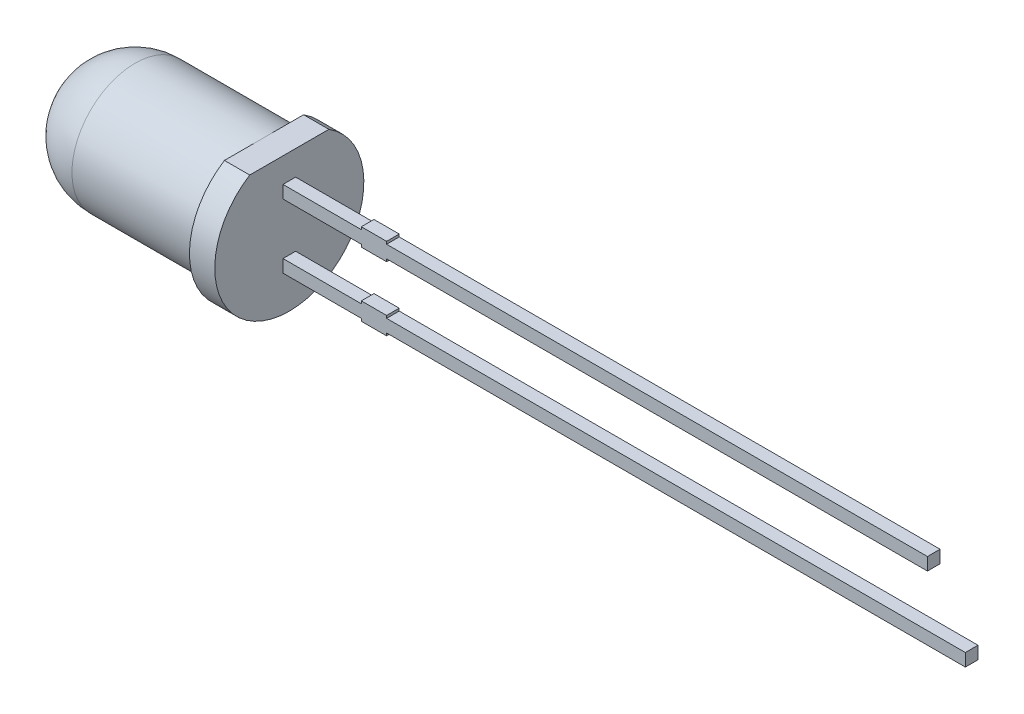
ISO-10303-21;
HEADER;
FILE_DESCRIPTION(('STEP AP214'),'2;1');
FILE_NAME('part.step','',(''),(''),'','','');
FILE_SCHEMA(('AUTOMOTIVE_DESIGN { 1 0 10303 214 1 1 1 1 }'));
ENDSEC;
DATA;
#1=APPLICATION_CONTEXT('core data for automotive mechanical design processes');
#2=APPLICATION_PROTOCOL_DEFINITION('international standard','automotive_design',2000,#1);
#3=PRODUCT_CONTEXT('',#1,'mechanical');
#4=PRODUCT('Part','Part','',(#3));
#5=PRODUCT_RELATED_PRODUCT_CATEGORY('part','',(#4));
#6=PRODUCT_DEFINITION_FORMATION('','',#4);
#7=PRODUCT_DEFINITION_CONTEXT('part definition',#1,'design');
#8=PRODUCT_DEFINITION('design','',#6,#7);
#9=PRODUCT_DEFINITION_SHAPE('','',#8);
#10=(LENGTH_UNIT() NAMED_UNIT(*) SI_UNIT(.MILLI.,.METRE.));
#11=(NAMED_UNIT(*) PLANE_ANGLE_UNIT() SI_UNIT($,.RADIAN.));
#12=(NAMED_UNIT(*) SI_UNIT($,.STERADIAN.) SOLID_ANGLE_UNIT());
#13=UNCERTAINTY_MEASURE_WITH_UNIT(LENGTH_MEASURE(1.E-05),#10,'distance_accuracy_value','');
#14=(GEOMETRIC_REPRESENTATION_CONTEXT(3) GLOBAL_UNCERTAINTY_ASSIGNED_CONTEXT((#13)) GLOBAL_UNIT_ASSIGNED_CONTEXT((#10,
#11,#12)) REPRESENTATION_CONTEXT('',''));
#15=CARTESIAN_POINT('',(0.,0.,0.));
#16=DIRECTION('',(0.,0.,1.));
#17=DIRECTION('',(1.,0.,0.));
#18=AXIS2_PLACEMENT_3D('',#15,#16,#17);
#19=CARTESIAN_POINT('',(440.087838274769,127.91233816873,-0.25));
#20=DIRECTION('',(0.,0.,1.));
#21=DIRECTION('',(0.,-1.,0.));
#22=AXIS2_PLACEMENT_3D('',#19,#20,#21);
#23=SPHERICAL_SURFACE('',#22,2.5);
#24=CARTESIAN_POINT('',(440.087838274769,127.91233816873,-0.25));
#25=DIRECTION('',(1.,0.,0.));
#26=DIRECTION('',(0.,0.,-1.));
#27=AXIS2_PLACEMENT_3D('',#24,#25,#26);
#28=SPHERICAL_SURFACE('',#27,2.5);
#29=CARTESIAN_POINT('',(440.087838274769,127.91233816873,-0.249999999999999));
#30=DIRECTION('',(1.,0.,0.));
#31=DIRECTION('',(0.,0.,-1.));
#32=AXIS2_PLACEMENT_3D('',#29,#30,#31);
#33=CIRCLE('',#32,2.5);
#34=CARTESIAN_POINT('',(440.087838274769,127.91233816873,-2.75));
#35=VERTEX_POINT('',#34);
#36=EDGE_CURVE('E18',#35,#35,#33,.T.);
#37=ORIENTED_EDGE('',*,*,#36,.F.);
#38=EDGE_LOOP('',(#37));
#39=FACE_BOUND('',#38,.T.);
#40=ADVANCED_FACE('F14',(#39),#28,.T.);
#41=CARTESIAN_POINT('',(440.087838274769,127.91233816873,-0.249999999999999));
#42=DIRECTION('',(1.,0.,0.));
#43=DIRECTION('',(0.,0.,-1.));
#44=AXIS2_PLACEMENT_3D('',#41,#42,#43);
#45=CYLINDRICAL_SURFACE('',#44,2.5);
#46=ORIENTED_EDGE('',*,*,#36,.T.);
#47=EDGE_LOOP('',(#46));
#48=FACE_BOUND('',#47,.T.);
#49=CARTESIAN_POINT('',(445.187838274769,127.91233816873,-0.249999999999999));
#50=DIRECTION('',(1.,0.,0.));
#51=DIRECTION('',(0.,0.,-1.));
#52=AXIS2_PLACEMENT_3D('',#49,#50,#51);
#53=CIRCLE('',#52,2.5);
#54=CARTESIAN_POINT('',(445.187838274769,130.41233816873,-0.25));
#55=VERTEX_POINT('',#54);
#56=EDGE_CURVE('E29',#55,#55,#53,.T.);
#57=ORIENTED_EDGE('',*,*,#56,.F.);
#58=EDGE_LOOP('',(#57));
#59=FACE_BOUND('',#58,.T.);
#60=ADVANCED_FACE('F737',(#48,#59),#45,.T.);
#61=CARTESIAN_POINT('',(450.287838274769,126.89233816873,0.));
#62=DIRECTION('',(0.,1.,0.));
#63=DIRECTION('',(1.,0.,0.));
#64=AXIS2_PLACEMENT_3D('',#61,#62,#63);
#65=PLANE('',#64);
#66=DIRECTION('',(-1.,0.,0.));
#67=VECTOR('',#66,1.);
#68=CARTESIAN_POINT('',(459.687838274769,126.89233816873,0.));
#69=LINE('',#68,#67);
#70=CARTESIAN_POINT('',(473.187838274769,126.89233816873,0.));
#71=VERTEX_POINT('',#70);
#72=CARTESIAN_POINT('',(450.287838274769,126.89233816873,0.));
#73=VERTEX_POINT('',#72);
#74=EDGE_CURVE('E311',#71,#73,#69,.T.);
#75=ORIENTED_EDGE('',*,*,#74,.F.);
#76=DIRECTION('',(0.,0.,1.));
#77=VECTOR('',#76,1.);
#78=CARTESIAN_POINT('',(473.187838274769,126.89233816873,-0.25));
#79=LINE('',#78,#77);
#80=CARTESIAN_POINT('',(473.187838274769,126.89233816873,-0.5));
#81=VERTEX_POINT('',#80);
#82=EDGE_CURVE('E395',#81,#71,#79,.T.);
#83=ORIENTED_EDGE('',*,*,#82,.F.);
#84=DIRECTION('',(1.,0.,0.));
#85=VECTOR('',#84,1.);
#86=CARTESIAN_POINT('',(459.687838274769,126.89233816873,-0.5));
#87=LINE('',#86,#85);
#88=CARTESIAN_POINT('',(450.287838274769,126.89233816873,-0.5));
#89=VERTEX_POINT('',#88);
#90=EDGE_CURVE('E322',#89,#81,#87,.T.);
#91=ORIENTED_EDGE('',*,*,#90,.F.);
#92=DIRECTION('',(0.,0.,-1.));
#93=VECTOR('',#92,1.);
#94=CARTESIAN_POINT('',(450.287838274769,126.89233816873,-0.25));
#95=LINE('',#94,#93);
#96=EDGE_CURVE('E413',#73,#89,#95,.T.);
#97=ORIENTED_EDGE('',*,*,#96,.F.);
#98=EDGE_LOOP('',(#75,#83,#91,#97));
#99=FACE_BOUND('',#98,.T.);
#100=ADVANCED_FACE('F438',(#99),#65,.T.);
#101=CARTESIAN_POINT('',(450.287838274769,126.99233816873,-0.5));
#102=DIRECTION('',(1.,0.,0.));
#103=DIRECTION('',(0.,0.,1.));
#104=AXIS2_PLACEMENT_3D('',#101,#102,#103);
#105=PLANE('',#104);
#106=DIRECTION('',(0.,0.,-1.));
#107=VECTOR('',#106,1.);
#108=CARTESIAN_POINT('',(450.287838274769,126.99233816873,-0.25));
#109=LINE('',#108,#107);
#110=CARTESIAN_POINT('',(450.287838274769,126.99233816873,0.));
#111=VERTEX_POINT('',#110);
#112=CARTESIAN_POINT('',(450.287838274769,126.99233816873,-0.5));
#113=VERTEX_POINT('',#112);
#114=EDGE_CURVE('E411',#111,#113,#109,.T.);
#115=ORIENTED_EDGE('',*,*,#114,.F.);
#116=DIRECTION('',(0.,1.,0.));
#117=VECTOR('',#116,1.);
#118=CARTESIAN_POINT('',(450.287838274769,126.64233816873,0.));
#119=LINE('',#118,#117);
#120=EDGE_CURVE('E308',#73,#111,#119,.T.);
#121=ORIENTED_EDGE('',*,*,#120,.F.);
#122=ORIENTED_EDGE('',*,*,#96,.T.);
#123=DIRECTION('',(0.,-1.,0.));
#124=VECTOR('',#123,1.);
#125=CARTESIAN_POINT('',(450.287838274769,126.64233816873,-0.5));
#126=LINE('',#125,#124);
#127=EDGE_CURVE('E325',#113,#89,#126,.T.);
#128=ORIENTED_EDGE('',*,*,#127,.F.);
#129=EDGE_LOOP('',(#115,#121,#122,#128));
#130=FACE_BOUND('',#129,.T.);
#131=ADVANCED_FACE('F435',(#130),#105,.T.);
#132=CARTESIAN_POINT('',(449.287838274769,126.99233816873,0.));
#133=DIRECTION('',(0.,1.,0.));
#134=DIRECTION('',(1.,0.,0.));
#135=AXIS2_PLACEMENT_3D('',#132,#133,#134);
#136=PLANE('',#135);
#137=DIRECTION('',(-1.,0.,0.));
#138=VECTOR('',#137,1.);
#139=CARTESIAN_POINT('',(459.687838274769,126.99233816873,0.));
#140=LINE('',#139,#138);
#141=CARTESIAN_POINT('',(449.287838274769,126.99233816873,0.));
#142=VERTEX_POINT('',#141);
#143=EDGE_CURVE('E305',#111,#142,#140,.T.);
#144=ORIENTED_EDGE('',*,*,#143,.F.);
#145=ORIENTED_EDGE('',*,*,#114,.T.);
#146=DIRECTION('',(1.,0.,0.));
#147=VECTOR('',#146,1.);
#148=CARTESIAN_POINT('',(459.687838274769,126.99233816873,-0.5));
#149=LINE('',#148,#147);
#150=CARTESIAN_POINT('',(449.287838274769,126.99233816873,-0.5));
#151=VERTEX_POINT('',#150);
#152=EDGE_CURVE('E328',#151,#113,#149,.T.);
#153=ORIENTED_EDGE('',*,*,#152,.F.);
#154=DIRECTION('',(0.,0.,-1.));
#155=VECTOR('',#154,1.);
#156=CARTESIAN_POINT('',(449.287838274769,126.99233816873,-0.25));
#157=LINE('',#156,#155);
#158=EDGE_CURVE('E314',#142,#151,#157,.T.);
#159=ORIENTED_EDGE('',*,*,#158,.F.);
#160=EDGE_LOOP('',(#144,#145,#153,#159));
#161=FACE_BOUND('',#160,.T.);
#162=ADVANCED_FACE('F431',(#161),#136,.T.);
#163=CARTESIAN_POINT('',(446.187838274769,126.39233816873,0.));
#164=DIRECTION('',(0.,-1.,0.));
#165=DIRECTION('',(0.,0.,-1.));
#166=AXIS2_PLACEMENT_3D('',#163,#164,#165);
#167=PLANE('',#166);
#168=DIRECTION('',(0.,0.,-1.));
#169=VECTOR('',#168,1.);
#170=CARTESIAN_POINT('',(446.187838274769,126.39233816873,-0.25));
#171=LINE('',#170,#169);
#172=CARTESIAN_POINT('',(446.187838274769,126.39233816873,0.));
#173=VERTEX_POINT('',#172);
#174=CARTESIAN_POINT('',(446.187838274769,126.39233816873,-0.5));
#175=VERTEX_POINT('',#174);
#176=EDGE_CURVE('E409',#173,#175,#171,.T.);
#177=ORIENTED_EDGE('',*,*,#176,.T.);
#178=DIRECTION('',(-1.,0.,0.));
#179=VECTOR('',#178,1.);
#180=CARTESIAN_POINT('',(459.687838274769,126.39233816873,-0.5));
#181=LINE('',#180,#179);
#182=CARTESIAN_POINT('',(449.287838274769,126.39233816873,-0.5));
#183=VERTEX_POINT('',#182);
#184=EDGE_CURVE('E333',#183,#175,#181,.T.);
#185=ORIENTED_EDGE('',*,*,#184,.F.);
#186=DIRECTION('',(0.,0.,-1.));
#187=VECTOR('',#186,1.);
#188=CARTESIAN_POINT('',(449.287838274769,126.39233816873,-0.25));
#189=LINE('',#188,#187);
#190=CARTESIAN_POINT('',(449.287838274769,126.39233816873,0.));
#191=VERTEX_POINT('',#190);
#192=EDGE_CURVE('E407',#191,#183,#189,.T.);
#193=ORIENTED_EDGE('',*,*,#192,.F.);
#194=DIRECTION('',(1.,0.,0.));
#195=VECTOR('',#194,1.);
#196=CARTESIAN_POINT('',(459.687838274769,126.39233816873,0.));
#197=LINE('',#196,#195);
#198=EDGE_CURVE('E296',#173,#191,#197,.T.);
#199=ORIENTED_EDGE('',*,*,#198,.F.);
#200=EDGE_LOOP('',(#177,#185,#193,#199));
#201=FACE_BOUND('',#200,.T.);
#202=ADVANCED_FACE('F461',(#201),#167,.T.);
#203=CARTESIAN_POINT('',(449.287838274769,126.29233816873,-0.5));
#204=DIRECTION('',(-1.,0.,0.));
#205=DIRECTION('',(0.,0.,1.));
#206=AXIS2_PLACEMENT_3D('',#203,#204,#205);
#207=PLANE('',#206);
#208=DIRECTION('',(0.,0.,-1.));
#209=VECTOR('',#208,1.);
#210=CARTESIAN_POINT('',(449.287838274769,126.29233816873,-0.25));
#211=LINE('',#210,#209);
#212=CARTESIAN_POINT('',(449.287838274769,126.29233816873,0.));
#213=VERTEX_POINT('',#212);
#214=CARTESIAN_POINT('',(449.287838274769,126.29233816873,-0.5));
#215=VERTEX_POINT('',#214);
#216=EDGE_CURVE('E405',#213,#215,#211,.T.);
#217=ORIENTED_EDGE('',*,*,#216,.F.);
#218=DIRECTION('',(0.,-1.,0.));
#219=VECTOR('',#218,1.);
#220=CARTESIAN_POINT('',(449.287838274769,126.64233816873,0.));
#221=LINE('',#220,#219);
#222=EDGE_CURVE('E293',#191,#213,#221,.T.);
#223=ORIENTED_EDGE('',*,*,#222,.F.);
#224=ORIENTED_EDGE('',*,*,#192,.T.);
#225=DIRECTION('',(0.,1.,0.));
#226=VECTOR('',#225,1.);
#227=CARTESIAN_POINT('',(449.287838274769,126.64233816873,-0.5));
#228=LINE('',#227,#226);
#229=EDGE_CURVE('E336',#215,#183,#228,.T.);
#230=ORIENTED_EDGE('',*,*,#229,.F.);
#231=EDGE_LOOP('',(#217,#223,#224,#230));
#232=FACE_BOUND('',#231,.T.);
#233=ADVANCED_FACE('F457',(#232),#207,.T.);
#234=CARTESIAN_POINT('',(449.287838274769,126.29233816873,-0.5));
#235=DIRECTION('',(0.,-1.,0.));
#236=DIRECTION('',(1.,0.,0.));
#237=AXIS2_PLACEMENT_3D('',#234,#235,#236);
#238=PLANE('',#237);
#239=DIRECTION('',(-1.,0.,0.));
#240=VECTOR('',#239,1.);
#241=CARTESIAN_POINT('',(459.687838274769,126.29233816873,-0.5));
#242=LINE('',#241,#240);
#243=CARTESIAN_POINT('',(450.287838274769,126.29233816873,-0.5));
#244=VERTEX_POINT('',#243);
#245=EDGE_CURVE('E339',#244,#215,#242,.T.);
#246=ORIENTED_EDGE('',*,*,#245,.F.);
#247=DIRECTION('',(0.,0.,-1.));
#248=VECTOR('',#247,1.);
#249=CARTESIAN_POINT('',(450.287838274769,126.29233816873,-0.25));
#250=LINE('',#249,#248);
#251=CARTESIAN_POINT('',(450.287838274769,126.29233816873,0.));
#252=VERTEX_POINT('',#251);
#253=EDGE_CURVE('E403',#252,#244,#250,.T.);
#254=ORIENTED_EDGE('',*,*,#253,.F.);
#255=DIRECTION('',(1.,0.,0.));
#256=VECTOR('',#255,1.);
#257=CARTESIAN_POINT('',(459.687838274769,126.29233816873,0.));
#258=LINE('',#257,#256);
#259=EDGE_CURVE('E290',#213,#252,#258,.T.);
#260=ORIENTED_EDGE('',*,*,#259,.F.);
#261=ORIENTED_EDGE('',*,*,#216,.T.);
#262=EDGE_LOOP('',(#246,#254,#260,#261));
#263=FACE_BOUND('',#262,.T.);
#264=ADVANCED_FACE('F453',(#263),#238,.T.);
#265=CARTESIAN_POINT('',(450.287838274769,126.39233816873,-0.5));
#266=DIRECTION('',(1.,0.,0.));
#267=DIRECTION('',(0.,0.,1.));
#268=AXIS2_PLACEMENT_3D('',#265,#266,#267);
#269=PLANE('',#268);
#270=DIRECTION('',(0.,0.,-1.));
#271=VECTOR('',#270,1.);
#272=CARTESIAN_POINT('',(450.287838274769,126.39233816873,-0.25));
#273=LINE('',#272,#271);
#274=CARTESIAN_POINT('',(450.287838274769,126.39233816873,0.));
#275=VERTEX_POINT('',#274);
#276=CARTESIAN_POINT('',(450.287838274769,126.39233816873,-0.5));
#277=VERTEX_POINT('',#276);
#278=EDGE_CURVE('E400',#275,#277,#273,.T.);
#279=ORIENTED_EDGE('',*,*,#278,.F.);
#280=DIRECTION('',(0.,1.,0.));
#281=VECTOR('',#280,1.);
#282=CARTESIAN_POINT('',(450.287838274769,126.64233816873,0.));
#283=LINE('',#282,#281);
#284=EDGE_CURVE('E287',#252,#275,#283,.T.);
#285=ORIENTED_EDGE('',*,*,#284,.F.);
#286=ORIENTED_EDGE('',*,*,#253,.T.);
#287=DIRECTION('',(0.,-1.,0.));
#288=VECTOR('',#287,1.);
#289=CARTESIAN_POINT('',(450.287838274769,126.64233816873,-0.5));
#290=LINE('',#289,#288);
#291=EDGE_CURVE('E342',#277,#244,#290,.T.);
#292=ORIENTED_EDGE('',*,*,#291,.F.);
#293=EDGE_LOOP('',(#279,#285,#286,#292));
#294=FACE_BOUND('',#293,.T.);
#295=ADVANCED_FACE('F449',(#294),#269,.T.);
#296=CARTESIAN_POINT('',(450.287838274769,126.39233816873,-0.5));
#297=DIRECTION('',(0.,-1.,0.));
#298=DIRECTION('',(1.,0.,0.));
#299=AXIS2_PLACEMENT_3D('',#296,#297,#298);
#300=PLANE('',#299);
#301=DIRECTION('',(-1.,0.,0.));
#302=VECTOR('',#301,1.);
#303=CARTESIAN_POINT('',(459.687838274769,126.39233816873,-0.5));
#304=LINE('',#303,#302);
#305=CARTESIAN_POINT('',(473.187838274769,126.39233816873,-0.5));
#306=VERTEX_POINT('',#305);
#307=EDGE_CURVE('E315',#306,#277,#304,.T.);
#308=ORIENTED_EDGE('',*,*,#307,.F.);
#309=DIRECTION('',(0.,0.,-1.));
#310=VECTOR('',#309,1.);
#311=CARTESIAN_POINT('',(473.187838274769,126.39233816873,-0.25));
#312=LINE('',#311,#310);
#313=CARTESIAN_POINT('',(473.187838274769,126.39233816873,0.));
#314=VERTEX_POINT('',#313);
#315=EDGE_CURVE('E398',#314,#306,#312,.T.);
#316=ORIENTED_EDGE('',*,*,#315,.F.);
#317=DIRECTION('',(1.,0.,0.));
#318=VECTOR('',#317,1.);
#319=CARTESIAN_POINT('',(459.687838274769,126.39233816873,0.));
#320=LINE('',#319,#318);
#321=EDGE_CURVE('E284',#275,#314,#320,.T.);
#322=ORIENTED_EDGE('',*,*,#321,.F.);
#323=ORIENTED_EDGE('',*,*,#278,.T.);
#324=EDGE_LOOP('',(#308,#316,#322,#323));
#325=FACE_BOUND('',#324,.T.);
#326=ADVANCED_FACE('F445',(#325),#300,.T.);
#327=CARTESIAN_POINT('',(473.187838274769,126.89233816873,-0.5));
#328=DIRECTION('',(1.,0.,0.));
#329=DIRECTION('',(0.,0.,1.));
#330=AXIS2_PLACEMENT_3D('',#327,#328,#329);
#331=PLANE('',#330);
#332=ORIENTED_EDGE('',*,*,#82,.T.);
#333=DIRECTION('',(0.,1.,0.));
#334=VECTOR('',#333,1.);
#335=CARTESIAN_POINT('',(473.187838274769,126.64233816873,0.));
#336=LINE('',#335,#334);
#337=EDGE_CURVE('E281',#314,#71,#336,.T.);
#338=ORIENTED_EDGE('',*,*,#337,.F.);
#339=ORIENTED_EDGE('',*,*,#315,.T.);
#340=DIRECTION('',(0.,-1.,0.));
#341=VECTOR('',#340,1.);
#342=CARTESIAN_POINT('',(473.187838274769,126.64233816873,-0.5));
#343=LINE('',#342,#341);
#344=EDGE_CURVE('E319',#81,#306,#343,.T.);
#345=ORIENTED_EDGE('',*,*,#344,.F.);
#346=EDGE_LOOP('',(#332,#338,#339,#345));
#347=FACE_BOUND('',#346,.T.);
#348=ADVANCED_FACE('F442',(#347),#331,.T.);
#349=CARTESIAN_POINT('',(450.287838274769,129.43233816873,0.));
#350=DIRECTION('',(0.,1.,0.));
#351=DIRECTION('',(1.,0.,0.));
#352=AXIS2_PLACEMENT_3D('',#349,#350,#351);
#353=PLANE('',#352);
#354=DIRECTION('',(-1.,0.,0.));
#355=VECTOR('',#354,1.);
#356=CARTESIAN_POINT('',(458.937838274769,129.432338168731,0.));
#357=LINE('',#356,#355);
#358=CARTESIAN_POINT('',(471.687838274768,129.432338168731,0.));
#359=VERTEX_POINT('',#358);
#360=CARTESIAN_POINT('',(450.287838274769,129.43233816873,0.));
#361=VERTEX_POINT('',#360);
#362=EDGE_CURVE('E247',#359,#361,#357,.T.);
#363=ORIENTED_EDGE('',*,*,#362,.F.);
#364=DIRECTION('',(0.,0.,1.));
#365=VECTOR('',#364,1.);
#366=CARTESIAN_POINT('',(471.687838274768,129.432338168731,-0.25));
#367=LINE('',#366,#365);
#368=CARTESIAN_POINT('',(471.687838274768,129.43233816873,-0.5));
#369=VERTEX_POINT('',#368);
#370=EDGE_CURVE('E375',#369,#359,#367,.T.);
#371=ORIENTED_EDGE('',*,*,#370,.F.);
#372=DIRECTION('',(1.,0.,0.));
#373=VECTOR('',#372,1.);
#374=CARTESIAN_POINT('',(458.937838274769,129.43233816873,-0.5));
#375=LINE('',#374,#373);
#376=CARTESIAN_POINT('',(450.287838274769,129.43233816873,-0.5));
#377=VERTEX_POINT('',#376);
#378=EDGE_CURVE('E258',#377,#369,#375,.T.);
#379=ORIENTED_EDGE('',*,*,#378,.F.);
#380=DIRECTION('',(0.,0.,-1.));
#381=VECTOR('',#380,1.);
#382=CARTESIAN_POINT('',(450.287838274769,129.43233816873,-0.25));
#383=LINE('',#382,#381);
#384=EDGE_CURVE('E393',#361,#377,#383,.T.);
#385=ORIENTED_EDGE('',*,*,#384,.F.);
#386=EDGE_LOOP('',(#363,#371,#379,#385));
#387=FACE_BOUND('',#386,.T.);
#388=ADVANCED_FACE('F529',(#387),#353,.T.);
#389=CARTESIAN_POINT('',(450.287838274769,129.53233816873,-0.5));
#390=DIRECTION('',(1.,0.,0.));
#391=DIRECTION('',(0.,0.,1.));
#392=AXIS2_PLACEMENT_3D('',#389,#390,#391);
#393=PLANE('',#392);
#394=DIRECTION('',(0.,0.,-1.));
#395=VECTOR('',#394,1.);
#396=CARTESIAN_POINT('',(450.287838274769,129.53233816873,-0.25));
#397=LINE('',#396,#395);
#398=CARTESIAN_POINT('',(450.287838274769,129.53233816873,0.));
#399=VERTEX_POINT('',#398);
#400=CARTESIAN_POINT('',(450.287838274769,129.53233816873,-0.5));
#401=VERTEX_POINT('',#400);
#402=EDGE_CURVE('E391',#399,#401,#397,.T.);
#403=ORIENTED_EDGE('',*,*,#402,.F.);
#404=DIRECTION('',(0.,1.,0.));
#405=VECTOR('',#404,1.);
#406=CARTESIAN_POINT('',(450.287838274769,129.18233816873,0.));
#407=LINE('',#406,#405);
#408=EDGE_CURVE('E244',#361,#399,#407,.T.);
#409=ORIENTED_EDGE('',*,*,#408,.F.);
#410=ORIENTED_EDGE('',*,*,#384,.T.);
#411=DIRECTION('',(0.,-1.,0.));
#412=VECTOR('',#411,1.);
#413=CARTESIAN_POINT('',(450.287838274769,129.18233816873,-0.5));
#414=LINE('',#413,#412);
#415=EDGE_CURVE('E261',#401,#377,#414,.T.);
#416=ORIENTED_EDGE('',*,*,#415,.F.);
#417=EDGE_LOOP('',(#403,#409,#410,#416));
#418=FACE_BOUND('',#417,.T.);
#419=ADVANCED_FACE('F532',(#418),#393,.T.);
#420=CARTESIAN_POINT('',(449.287838274769,129.53233816873,0.));
#421=DIRECTION('',(0.,1.,0.));
#422=DIRECTION('',(1.,0.,0.));
#423=AXIS2_PLACEMENT_3D('',#420,#421,#422);
#424=PLANE('',#423);
#425=DIRECTION('',(-1.,0.,0.));
#426=VECTOR('',#425,1.);
#427=CARTESIAN_POINT('',(458.937838274769,129.53233816873,0.));
#428=LINE('',#427,#426);
#429=CARTESIAN_POINT('',(449.287838274769,129.53233816873,0.));
#430=VERTEX_POINT('',#429);
#431=EDGE_CURVE('E241',#399,#430,#428,.T.);
#432=ORIENTED_EDGE('',*,*,#431,.F.);
#433=ORIENTED_EDGE('',*,*,#402,.T.);
#434=DIRECTION('',(1.,0.,0.));
#435=VECTOR('',#434,1.);
#436=CARTESIAN_POINT('',(458.937838274769,129.53233816873,-0.5));
#437=LINE('',#436,#435);
#438=CARTESIAN_POINT('',(449.287838274769,129.53233816873,-0.5));
#439=VERTEX_POINT('',#438);
#440=EDGE_CURVE('E264',#439,#401,#437,.T.);
#441=ORIENTED_EDGE('',*,*,#440,.F.);
#442=DIRECTION('',(0.,0.,-1.));
#443=VECTOR('',#442,1.);
#444=CARTESIAN_POINT('',(449.287838274769,129.53233816873,-0.25));
#445=LINE('',#444,#443);
#446=EDGE_CURVE('E250',#430,#439,#445,.T.);
#447=ORIENTED_EDGE('',*,*,#446,.F.);
#448=EDGE_LOOP('',(#432,#433,#441,#447));
#449=FACE_BOUND('',#448,.T.);
#450=ADVANCED_FACE('F535',(#449),#424,.T.);
#451=CARTESIAN_POINT('',(446.187838274769,128.93233816873,0.));
#452=DIRECTION('',(0.,-1.,0.));
#453=DIRECTION('',(0.,0.,-1.));
#454=AXIS2_PLACEMENT_3D('',#451,#452,#453);
#455=PLANE('',#454);
#456=DIRECTION('',(0.,0.,-1.));
#457=VECTOR('',#456,1.);
#458=CARTESIAN_POINT('',(446.187838274769,128.93233816873,-0.25));
#459=LINE('',#458,#457);
#460=CARTESIAN_POINT('',(446.187838274769,128.93233816873,0.));
#461=VERTEX_POINT('',#460);
#462=CARTESIAN_POINT('',(446.187838274769,128.93233816873,-0.5));
#463=VERTEX_POINT('',#462);
#464=EDGE_CURVE('E389',#461,#463,#459,.T.);
#465=ORIENTED_EDGE('',*,*,#464,.T.);
#466=DIRECTION('',(-1.,0.,0.));
#467=VECTOR('',#466,1.);
#468=CARTESIAN_POINT('',(458.937838274769,128.93233816873,-0.5));
#469=LINE('',#468,#467);
#470=CARTESIAN_POINT('',(449.287838274769,128.93233816873,-0.5));
#471=VERTEX_POINT('',#470);
#472=EDGE_CURVE('E269',#471,#463,#469,.T.);
#473=ORIENTED_EDGE('',*,*,#472,.F.);
#474=DIRECTION('',(0.,0.,-1.));
#475=VECTOR('',#474,1.);
#476=CARTESIAN_POINT('',(449.287838274769,128.93233816873,-0.25));
#477=LINE('',#476,#475);
#478=CARTESIAN_POINT('',(449.287838274769,128.93233816873,0.));
#479=VERTEX_POINT('',#478);
#480=EDGE_CURVE('E387',#479,#471,#477,.T.);
#481=ORIENTED_EDGE('',*,*,#480,.F.);
#482=DIRECTION('',(1.,0.,0.));
#483=VECTOR('',#482,1.);
#484=CARTESIAN_POINT('',(458.937838274769,128.93233816873,0.));
#485=LINE('',#484,#483);
#486=EDGE_CURVE('E234',#461,#479,#485,.T.);
#487=ORIENTED_EDGE('',*,*,#486,.F.);
#488=EDGE_LOOP('',(#465,#473,#481,#487));
#489=FACE_BOUND('',#488,.T.);
#490=ADVANCED_FACE('F508',(#489),#455,.T.);
#491=CARTESIAN_POINT('',(449.287838274769,128.83233816873,-0.5));
#492=DIRECTION('',(-1.,0.,0.));
#493=DIRECTION('',(0.,0.,1.));
#494=AXIS2_PLACEMENT_3D('',#491,#492,#493);
#495=PLANE('',#494);
#496=DIRECTION('',(0.,0.,-1.));
#497=VECTOR('',#496,1.);
#498=CARTESIAN_POINT('',(449.287838274769,128.83233816873,-0.25));
#499=LINE('',#498,#497);
#500=CARTESIAN_POINT('',(449.287838274769,128.83233816873,0.));
#501=VERTEX_POINT('',#500);
#502=CARTESIAN_POINT('',(449.287838274769,128.83233816873,-0.5));
#503=VERTEX_POINT('',#502);
#504=EDGE_CURVE('E385',#501,#503,#499,.T.);
#505=ORIENTED_EDGE('',*,*,#504,.F.);
#506=DIRECTION('',(0.,-1.,0.));
#507=VECTOR('',#506,1.);
#508=CARTESIAN_POINT('',(449.287838274769,129.18233816873,0.));
#509=LINE('',#508,#507);
#510=EDGE_CURVE('E231',#479,#501,#509,.T.);
#511=ORIENTED_EDGE('',*,*,#510,.F.);
#512=ORIENTED_EDGE('',*,*,#480,.T.);
#513=DIRECTION('',(0.,1.,0.));
#514=VECTOR('',#513,1.);
#515=CARTESIAN_POINT('',(449.287838274769,129.18233816873,-0.5));
#516=LINE('',#515,#514);
#517=EDGE_CURVE('E272',#503,#471,#516,.T.);
#518=ORIENTED_EDGE('',*,*,#517,.F.);
#519=EDGE_LOOP('',(#505,#511,#512,#518));
#520=FACE_BOUND('',#519,.T.);
#521=ADVANCED_FACE('F512',(#520),#495,.T.);
#522=CARTESIAN_POINT('',(449.287838274769,128.83233816873,-0.5));
#523=DIRECTION('',(0.,-1.,0.));
#524=DIRECTION('',(1.,0.,0.));
#525=AXIS2_PLACEMENT_3D('',#522,#523,#524);
#526=PLANE('',#525);
#527=DIRECTION('',(-1.,0.,0.));
#528=VECTOR('',#527,1.);
#529=CARTESIAN_POINT('',(458.937838274769,128.83233816873,-0.5));
#530=LINE('',#529,#528);
#531=CARTESIAN_POINT('',(450.287838274769,128.83233816873,-0.5));
#532=VERTEX_POINT('',#531);
#533=EDGE_CURVE('E275',#532,#503,#530,.T.);
#534=ORIENTED_EDGE('',*,*,#533,.F.);
#535=DIRECTION('',(0.,0.,-1.));
#536=VECTOR('',#535,1.);
#537=CARTESIAN_POINT('',(450.287838274769,128.83233816873,-0.25));
#538=LINE('',#537,#536);
#539=CARTESIAN_POINT('',(450.287838274769,128.83233816873,0.));
#540=VERTEX_POINT('',#539);
#541=EDGE_CURVE('E383',#540,#532,#538,.T.);
#542=ORIENTED_EDGE('',*,*,#541,.F.);
#543=DIRECTION('',(1.,0.,0.));
#544=VECTOR('',#543,1.);
#545=CARTESIAN_POINT('',(458.937838274769,128.83233816873,0.));
#546=LINE('',#545,#544);
#547=EDGE_CURVE('E228',#501,#540,#546,.T.);
#548=ORIENTED_EDGE('',*,*,#547,.F.);
#549=ORIENTED_EDGE('',*,*,#504,.T.);
#550=EDGE_LOOP('',(#534,#542,#548,#549));
#551=FACE_BOUND('',#550,.T.);
#552=ADVANCED_FACE('F515',(#551),#526,.T.);
#553=CARTESIAN_POINT('',(450.287838274769,128.93233816873,-0.5));
#554=DIRECTION('',(1.,0.,0.));
#555=DIRECTION('',(0.,0.,1.));
#556=AXIS2_PLACEMENT_3D('',#553,#554,#555);
#557=PLANE('',#556);
#558=DIRECTION('',(0.,0.,-1.));
#559=VECTOR('',#558,1.);
#560=CARTESIAN_POINT('',(450.287838274769,128.93233816873,-0.25));
#561=LINE('',#560,#559);
#562=CARTESIAN_POINT('',(450.287838274769,128.93233816873,0.));
#563=VERTEX_POINT('',#562);
#564=CARTESIAN_POINT('',(450.287838274769,128.93233816873,-0.5));
#565=VERTEX_POINT('',#564);
#566=EDGE_CURVE('E380',#563,#565,#561,.T.);
#567=ORIENTED_EDGE('',*,*,#566,.F.);
#568=DIRECTION('',(0.,1.,0.));
#569=VECTOR('',#568,1.);
#570=CARTESIAN_POINT('',(450.287838274769,129.18233816873,0.));
#571=LINE('',#570,#569);
#572=EDGE_CURVE('E225',#540,#563,#571,.T.);
#573=ORIENTED_EDGE('',*,*,#572,.F.);
#574=ORIENTED_EDGE('',*,*,#541,.T.);
#575=DIRECTION('',(0.,-1.,0.));
#576=VECTOR('',#575,1.);
#577=CARTESIAN_POINT('',(450.287838274769,129.18233816873,-0.5));
#578=LINE('',#577,#576);
#579=EDGE_CURVE('E278',#565,#532,#578,.T.);
#580=ORIENTED_EDGE('',*,*,#579,.F.);
#581=EDGE_LOOP('',(#567,#573,#574,#580));
#582=FACE_BOUND('',#581,.T.);
#583=ADVANCED_FACE('F518',(#582),#557,.T.);
#584=CARTESIAN_POINT('',(450.287838274769,128.93233816873,-0.5));
#585=DIRECTION('',(0.,-1.,0.));
#586=DIRECTION('',(1.,0.,0.));
#587=AXIS2_PLACEMENT_3D('',#584,#585,#586);
#588=PLANE('',#587);
#589=DIRECTION('',(-1.,0.,0.));
#590=VECTOR('',#589,1.);
#591=CARTESIAN_POINT('',(458.937838274769,128.932338168731,-0.5));
#592=LINE('',#591,#590);
#593=CARTESIAN_POINT('',(471.687838274768,128.932338168731,-0.5));
#594=VERTEX_POINT('',#593);
#595=EDGE_CURVE('E251',#594,#565,#592,.T.);
#596=ORIENTED_EDGE('',*,*,#595,.F.);
#597=DIRECTION('',(0.,0.,-1.));
#598=VECTOR('',#597,1.);
#599=CARTESIAN_POINT('',(471.687838274768,128.932338168731,-0.25));
#600=LINE('',#599,#598);
#601=CARTESIAN_POINT('',(471.687838274768,128.93233816873,0.));
#602=VERTEX_POINT('',#601);
#603=EDGE_CURVE('E378',#602,#594,#600,.T.);
#604=ORIENTED_EDGE('',*,*,#603,.F.);
#605=DIRECTION('',(1.,0.,0.));
#606=VECTOR('',#605,1.);
#607=CARTESIAN_POINT('',(458.937838274769,128.93233816873,0.));
#608=LINE('',#607,#606);
#609=EDGE_CURVE('E222',#563,#602,#608,.T.);
#610=ORIENTED_EDGE('',*,*,#609,.F.);
#611=ORIENTED_EDGE('',*,*,#566,.T.);
#612=EDGE_LOOP('',(#596,#604,#610,#611));
#613=FACE_BOUND('',#612,.T.);
#614=ADVANCED_FACE('F523',(#613),#588,.T.);
#615=CARTESIAN_POINT('',(471.687838274768,129.432338168731,-0.5));
#616=DIRECTION('',(1.,0.,0.));
#617=DIRECTION('',(0.,0.,1.));
#618=AXIS2_PLACEMENT_3D('',#615,#616,#617);
#619=PLANE('',#618);
#620=ORIENTED_EDGE('',*,*,#370,.T.);
#621=DIRECTION('',(0.,1.,0.));
#622=VECTOR('',#621,1.);
#623=CARTESIAN_POINT('',(471.687838274768,129.18233816873,0.));
#624=LINE('',#623,#622);
#625=EDGE_CURVE('E219',#602,#359,#624,.T.);
#626=ORIENTED_EDGE('',*,*,#625,.F.);
#627=ORIENTED_EDGE('',*,*,#603,.T.);
#628=DIRECTION('',(0.,-1.,0.));
#629=VECTOR('',#628,1.);
#630=CARTESIAN_POINT('',(471.687838274768,129.18233816873,-0.5));
#631=LINE('',#630,#629);
#632=EDGE_CURVE('E255',#369,#594,#631,.T.);
#633=ORIENTED_EDGE('',*,*,#632,.F.);
#634=EDGE_LOOP('',(#620,#626,#627,#633));
#635=FACE_BOUND('',#634,.T.);
#636=ADVANCED_FACE('F526',(#635),#619,.T.);
#637=CARTESIAN_POINT('',(445.187838274769,130.41233816873,-3.69884043368549));
#638=DIRECTION('',(-1.,0.,0.));
#639=DIRECTION('',(0.,-1.,0.));
#640=AXIS2_PLACEMENT_3D('',#637,#638,#639);
#641=PLANE('',#640);
#642=CARTESIAN_POINT('',(445.187838274769,127.91233816873,-0.250000000000019));
#643=DIRECTION('',(-1.,0.,0.));
#644=DIRECTION('',(0.,0.,1.));
#645=AXIS2_PLACEMENT_3D('',#642,#643,#644);
#646=CIRCLE('',#645,2.95000000000003);
#647=CARTESIAN_POINT('',(445.187838274769,130.41233816873,1.31604597633659));
#648=VERTEX_POINT('',#647);
#649=CARTESIAN_POINT('',(445.187838274769,130.41233816873,-1.81604597633659));
#650=VERTEX_POINT('',#649);
#651=EDGE_CURVE('E191',#648,#650,#646,.F.);
#652=ORIENTED_EDGE('',*,*,#651,.F.);
#653=CARTESIAN_POINT('',(445.187838274769,130.41233816873,1.31604597633659));
#654=CARTESIAN_POINT('',(445.187838274769,130.41233816873,-1.81604597633659));
#655=B_SPLINE_CURVE_WITH_KNOTS('',1,(#653,#654),.UNSPECIFIED.,.F.,.F.,(2,2),(0.,
3.13209195267318),.UNSPECIFIED.);
#656=EDGE_CURVE('E194',#55,#648,#655,.F.);
#657=ORIENTED_EDGE('',*,*,#656,.F.);
#658=ORIENTED_EDGE('',*,*,#56,.T.);
#659=EDGE_CURVE('E196',#650,#55,#655,.F.);
#660=ORIENTED_EDGE('',*,*,#659,.F.);
#661=EDGE_LOOP('',(#652,#657,#658,#660));
#662=FACE_BOUND('',#661,.T.);
#663=ADVANCED_FACE('F193',(#662),#641,.T.);
#664=CARTESIAN_POINT('',(446.187838274769,126.29233816873,-0.5));
#665=DIRECTION('',(0.,0.,-1.));
#666=DIRECTION('',(0.,1.,0.));
#667=AXIS2_PLACEMENT_3D('',#664,#665,#666);
#668=PLANE('',#667);
#669=ORIENTED_EDGE('',*,*,#344,.T.);
#670=ORIENTED_EDGE('',*,*,#307,.T.);
#671=ORIENTED_EDGE('',*,*,#291,.T.);
#672=ORIENTED_EDGE('',*,*,#245,.T.);
#673=ORIENTED_EDGE('',*,*,#229,.T.);
#674=ORIENTED_EDGE('',*,*,#184,.T.);
#675=DIRECTION('',(0.,1.,0.));
#676=VECTOR('',#675,1.);
#677=CARTESIAN_POINT('',(446.187838274769,126.64233816873,-0.5));
#678=LINE('',#677,#676);
#679=CARTESIAN_POINT('',(446.187838274769,126.89233816873,-0.5));
#680=VERTEX_POINT('',#679);
#681=EDGE_CURVE('E331',#175,#680,#678,.T.);
#682=ORIENTED_EDGE('',*,*,#681,.T.);
#683=DIRECTION('',(-1.,0.,0.));
#684=VECTOR('',#683,1.);
#685=CARTESIAN_POINT('',(447.737838274769,126.89233816873,-0.5));
#686=LINE('',#685,#684);
#687=CARTESIAN_POINT('',(449.287838274769,126.89233816873,-0.5));
#688=VERTEX_POINT('',#687);
#689=EDGE_CURVE('E200',#688,#680,#686,.T.);
#690=ORIENTED_EDGE('',*,*,#689,.F.);
#691=DIRECTION('',(0.,-1.,0.));
#692=VECTOR('',#691,1.);
#693=CARTESIAN_POINT('',(449.287838274769,126.94233816873,-0.5));
#694=LINE('',#693,#692);
#695=EDGE_CURVE('E318',#151,#688,#694,.T.);
#696=ORIENTED_EDGE('',*,*,#695,.F.);
#697=ORIENTED_EDGE('',*,*,#152,.T.);
#698=ORIENTED_EDGE('',*,*,#127,.T.);
#699=ORIENTED_EDGE('',*,*,#90,.T.);
#700=EDGE_LOOP('',(#669,#670,#671,#672,#673,#674,#682,#690,#696,#697,#698,#699));
#701=FACE_BOUND('',#700,.T.);
#702=ADVANCED_FACE('F425',(#701),#668,.T.);
#703=CARTESIAN_POINT('',(449.287838274769,126.89233816873,-0.5));
#704=DIRECTION('',(-1.,0.,0.));
#705=DIRECTION('',(0.,0.,1.));
#706=AXIS2_PLACEMENT_3D('',#703,#704,#705);
#707=PLANE('',#706);
#708=DIRECTION('',(0.,0.,-1.));
#709=VECTOR('',#708,1.);
#710=CARTESIAN_POINT('',(449.287838274769,126.89233816873,-0.25));
#711=LINE('',#710,#709);
#712=CARTESIAN_POINT('',(449.287838274769,126.89233816873,0.));
#713=VERTEX_POINT('',#712);
#714=EDGE_CURVE('E362',#713,#688,#711,.T.);
#715=ORIENTED_EDGE('',*,*,#714,.F.);
#716=DIRECTION('',(0.,-1.,0.));
#717=VECTOR('',#716,1.);
#718=CARTESIAN_POINT('',(449.287838274769,126.64233816873,0.));
#719=LINE('',#718,#717);
#720=EDGE_CURVE('E302',#142,#713,#719,.T.);
#721=ORIENTED_EDGE('',*,*,#720,.F.);
#722=ORIENTED_EDGE('',*,*,#158,.T.);
#723=ORIENTED_EDGE('',*,*,#695,.T.);
#724=EDGE_LOOP('',(#715,#721,#722,#723));
#725=FACE_BOUND('',#724,.T.);
#726=ADVANCED_FACE('F427',(#725),#707,.T.);
#727=CARTESIAN_POINT('',(446.187838274769,126.29233816873,0.));
#728=DIRECTION('',(0.,0.,1.));
#729=DIRECTION('',(1.,0.,0.));
#730=AXIS2_PLACEMENT_3D('',#727,#728,#729);
#731=PLANE('',#730);
#732=ORIENTED_EDGE('',*,*,#321,.T.);
#733=ORIENTED_EDGE('',*,*,#337,.T.);
#734=ORIENTED_EDGE('',*,*,#74,.T.);
#735=ORIENTED_EDGE('',*,*,#120,.T.);
#736=ORIENTED_EDGE('',*,*,#143,.T.);
#737=ORIENTED_EDGE('',*,*,#720,.T.);
#738=DIRECTION('',(1.,0.,0.));
#739=VECTOR('',#738,1.);
#740=CARTESIAN_POINT('',(447.737838274769,126.89233816873,0.));
#741=LINE('',#740,#739);
#742=CARTESIAN_POINT('',(446.187838274769,126.89233816873,0.));
#743=VERTEX_POINT('',#742);
#744=EDGE_CURVE('E359',#743,#713,#741,.T.);
#745=ORIENTED_EDGE('',*,*,#744,.F.);
#746=DIRECTION('',(0.,-1.,0.));
#747=VECTOR('',#746,1.);
#748=CARTESIAN_POINT('',(446.187838274769,126.64233816873,0.));
#749=LINE('',#748,#747);
#750=EDGE_CURVE('E299',#743,#173,#749,.T.);
#751=ORIENTED_EDGE('',*,*,#750,.T.);
#752=ORIENTED_EDGE('',*,*,#198,.T.);
#753=ORIENTED_EDGE('',*,*,#222,.T.);
#754=ORIENTED_EDGE('',*,*,#259,.T.);
#755=ORIENTED_EDGE('',*,*,#284,.T.);
#756=EDGE_LOOP('',(#732,#733,#734,#735,#736,#737,#745,#751,#752,#753,#754,#755));
#757=FACE_BOUND('',#756,.T.);
#758=ADVANCED_FACE('F463',(#757),#731,.T.);
#759=CARTESIAN_POINT('',(446.187838274769,128.83233816873,-0.5));
#760=DIRECTION('',(0.,0.,-1.));
#761=DIRECTION('',(0.,1.,0.));
#762=AXIS2_PLACEMENT_3D('',#759,#760,#761);
#763=PLANE('',#762);
#764=ORIENTED_EDGE('',*,*,#632,.T.);
#765=ORIENTED_EDGE('',*,*,#595,.T.);
#766=ORIENTED_EDGE('',*,*,#579,.T.);
#767=ORIENTED_EDGE('',*,*,#533,.T.);
#768=ORIENTED_EDGE('',*,*,#517,.T.);
#769=ORIENTED_EDGE('',*,*,#472,.T.);
#770=DIRECTION('',(0.,1.,0.));
#771=VECTOR('',#770,1.);
#772=CARTESIAN_POINT('',(446.187838274769,129.18233816873,-0.5));
#773=LINE('',#772,#771);
#774=CARTESIAN_POINT('',(446.187838274769,129.43233816873,-0.5));
#775=VERTEX_POINT('',#774);
#776=EDGE_CURVE('E267',#463,#775,#773,.T.);
#777=ORIENTED_EDGE('',*,*,#776,.T.);
#778=DIRECTION('',(-1.,0.,0.));
#779=VECTOR('',#778,1.);
#780=CARTESIAN_POINT('',(447.737838274769,129.43233816873,-0.5));
#781=LINE('',#780,#779);
#782=CARTESIAN_POINT('',(449.287838274769,129.43233816873,-0.5));
#783=VERTEX_POINT('',#782);
#784=EDGE_CURVE('E356',#783,#775,#781,.T.);
#785=ORIENTED_EDGE('',*,*,#784,.F.);
#786=DIRECTION('',(0.,-1.,0.));
#787=VECTOR('',#786,1.);
#788=CARTESIAN_POINT('',(449.287838274769,129.48233816873,-0.5));
#789=LINE('',#788,#787);
#790=EDGE_CURVE('E254',#439,#783,#789,.T.);
#791=ORIENTED_EDGE('',*,*,#790,.F.);
#792=ORIENTED_EDGE('',*,*,#440,.T.);
#793=ORIENTED_EDGE('',*,*,#415,.T.);
#794=ORIENTED_EDGE('',*,*,#378,.T.);
#795=EDGE_LOOP('',(#764,#765,#766,#767,#768,#769,#777,#785,#791,#792,#793,#794));
#796=FACE_BOUND('',#795,.T.);
#797=ADVANCED_FACE('F465',(#796),#763,.T.);
#798=CARTESIAN_POINT('',(449.287838274769,129.43233816873,-0.5));
#799=DIRECTION('',(-1.,0.,0.));
#800=DIRECTION('',(0.,0.,1.));
#801=AXIS2_PLACEMENT_3D('',#798,#799,#800);
#802=PLANE('',#801);
#803=DIRECTION('',(0.,0.,-1.));
#804=VECTOR('',#803,1.);
#805=CARTESIAN_POINT('',(449.287838274769,129.43233816873,-0.25));
#806=LINE('',#805,#804);
#807=CARTESIAN_POINT('',(449.287838274769,129.43233816873,0.));
#808=VERTEX_POINT('',#807);
#809=EDGE_CURVE('E353',#808,#783,#806,.T.);
#810=ORIENTED_EDGE('',*,*,#809,.F.);
#811=DIRECTION('',(0.,-1.,0.));
#812=VECTOR('',#811,1.);
#813=CARTESIAN_POINT('',(449.287838274769,129.18233816873,0.));
#814=LINE('',#813,#812);
#815=EDGE_CURVE('E238',#430,#808,#814,.T.);
#816=ORIENTED_EDGE('',*,*,#815,.F.);
#817=ORIENTED_EDGE('',*,*,#446,.T.);
#818=ORIENTED_EDGE('',*,*,#790,.T.);
#819=EDGE_LOOP('',(#810,#816,#817,#818));
#820=FACE_BOUND('',#819,.T.);
#821=ADVANCED_FACE('F472',(#820),#802,.T.);
#822=CARTESIAN_POINT('',(446.187838274769,128.83233816873,0.));
#823=DIRECTION('',(0.,0.,1.));
#824=DIRECTION('',(1.,0.,0.));
#825=AXIS2_PLACEMENT_3D('',#822,#823,#824);
#826=PLANE('',#825);
#827=ORIENTED_EDGE('',*,*,#609,.T.);
#828=ORIENTED_EDGE('',*,*,#625,.T.);
#829=ORIENTED_EDGE('',*,*,#362,.T.);
#830=ORIENTED_EDGE('',*,*,#408,.T.);
#831=ORIENTED_EDGE('',*,*,#431,.T.);
#832=ORIENTED_EDGE('',*,*,#815,.T.);
#833=DIRECTION('',(1.,0.,0.));
#834=VECTOR('',#833,1.);
#835=CARTESIAN_POINT('',(447.737838274769,129.43233816873,0.));
#836=LINE('',#835,#834);
#837=CARTESIAN_POINT('',(446.187838274769,129.43233816873,0.));
#838=VERTEX_POINT('',#837);
#839=EDGE_CURVE('E347',#838,#808,#836,.T.);
#840=ORIENTED_EDGE('',*,*,#839,.F.);
#841=DIRECTION('',(0.,-1.,0.));
#842=VECTOR('',#841,1.);
#843=CARTESIAN_POINT('',(446.187838274769,129.18233816873,0.));
#844=LINE('',#843,#842);
#845=EDGE_CURVE('E37',#838,#461,#844,.T.);
#846=ORIENTED_EDGE('',*,*,#845,.T.);
#847=ORIENTED_EDGE('',*,*,#486,.T.);
#848=ORIENTED_EDGE('',*,*,#510,.T.);
#849=ORIENTED_EDGE('',*,*,#547,.T.);
#850=ORIENTED_EDGE('',*,*,#572,.T.);
#851=EDGE_LOOP('',(#827,#828,#829,#830,#831,#832,#840,#846,#847,#848,#849,#850));
#852=FACE_BOUND('',#851,.T.);
#853=ADVANCED_FACE('F492',(#852),#826,.T.);
#854=CARTESIAN_POINT('',(445.187838274769,130.41233816873,1.31604597633659));
#855=DIRECTION('',(0.,1.,0.));
#856=DIRECTION('',(1.,0.,0.));
#857=AXIS2_PLACEMENT_3D('',#854,#855,#856);
#858=PLANE('',#857);
#859=DIRECTION('',(-1.,0.,0.));
#860=VECTOR('',#859,1.);
#861=CARTESIAN_POINT('',(445.687838274769,130.41233816873,1.31604597633658));
#862=LINE('',#861,#860);
#863=CARTESIAN_POINT('',(446.187838274769,130.41233816873,1.31604597633656));
#864=VERTEX_POINT('',#863);
#865=EDGE_CURVE('E201',#864,#648,#862,.T.);
#866=ORIENTED_EDGE('',*,*,#865,.F.);
#867=DIRECTION('',(0.,0.,1.));
#868=VECTOR('',#867,1.);
#869=CARTESIAN_POINT('',(446.187838274769,130.41233816873,-0.25));
#870=LINE('',#869,#868);
#871=CARTESIAN_POINT('',(446.187838274769,130.41233816873,-1.81604597633656));
#872=VERTEX_POINT('',#871);
#873=EDGE_CURVE('E216',#872,#864,#870,.T.);
#874=ORIENTED_EDGE('',*,*,#873,.F.);
#875=DIRECTION('',(1.,0.,0.));
#876=VECTOR('',#875,1.);
#877=CARTESIAN_POINT('',(445.687838274769,130.41233816873,-1.81604597633658));
#878=LINE('',#877,#876);
#879=EDGE_CURVE('E208',#650,#872,#878,.T.);
#880=ORIENTED_EDGE('',*,*,#879,.F.);
#881=ORIENTED_EDGE('',*,*,#659,.T.);
#882=ORIENTED_EDGE('',*,*,#656,.T.);
#883=EDGE_LOOP('',(#866,#874,#880,#881,#882));
#884=FACE_BOUND('',#883,.T.);
#885=ADVANCED_FACE('F205',(#884),#858,.T.);
#886=CARTESIAN_POINT('',(446.187838274769,127.91233816873,-0.25));
#887=DIRECTION('',(-1.,0.,0.));
#888=DIRECTION('',(0.,0.,1.));
#889=AXIS2_PLACEMENT_3D('',#886,#887,#888);
#890=CYLINDRICAL_SURFACE('',#889,2.95000000000003);
#891=ORIENTED_EDGE('',*,*,#865,.T.);
#892=ORIENTED_EDGE('',*,*,#651,.T.);
#893=ORIENTED_EDGE('',*,*,#879,.T.);
#894=CARTESIAN_POINT('',(446.187838274769,127.91233816873,-0.25));
#895=DIRECTION('',(-1.,0.,0.));
#896=DIRECTION('',(0.,0.,1.));
#897=AXIS2_PLACEMENT_3D('',#894,#895,#896);
#898=CIRCLE('',#897,2.95000000000003);
#899=EDGE_CURVE('E212',#864,#872,#898,.F.);
#900=ORIENTED_EDGE('',*,*,#899,.F.);
#901=EDGE_LOOP('',(#891,#892,#893,#900));
#902=FACE_BOUND('',#901,.T.);
#903=ADVANCED_FACE('F210',(#902),#890,.T.);
#904=CARTESIAN_POINT('',(446.187838274769,126.89233816873,-0.5));
#905=DIRECTION('',(0.,1.,0.));
#906=DIRECTION('',(0.,0.,1.));
#907=AXIS2_PLACEMENT_3D('',#904,#905,#906);
#908=PLANE('',#907);
#909=DIRECTION('',(0.,0.,-1.));
#910=VECTOR('',#909,1.);
#911=CARTESIAN_POINT('',(446.187838274769,126.89233816873,-0.25));
#912=LINE('',#911,#910);
#913=EDGE_CURVE('E23',#743,#680,#912,.T.);
#914=ORIENTED_EDGE('',*,*,#913,.F.);
#915=ORIENTED_EDGE('',*,*,#744,.T.);
#916=ORIENTED_EDGE('',*,*,#714,.T.);
#917=ORIENTED_EDGE('',*,*,#689,.T.);
#918=EDGE_LOOP('',(#914,#915,#916,#917));
#919=FACE_BOUND('',#918,.T.);
#920=ADVANCED_FACE('F422',(#919),#908,.T.);
#921=CARTESIAN_POINT('',(446.187838274769,129.43233816873,-0.5));
#922=DIRECTION('',(0.,1.,0.));
#923=DIRECTION('',(0.,0.,1.));
#924=AXIS2_PLACEMENT_3D('',#921,#922,#923);
#925=PLANE('',#924);
#926=DIRECTION('',(0.,0.,-1.));
#927=VECTOR('',#926,1.);
#928=CARTESIAN_POINT('',(446.187838274769,129.43233816873,-0.249999999999999));
#929=LINE('',#928,#927);
#930=EDGE_CURVE('E9',#838,#775,#929,.T.);
#931=ORIENTED_EDGE('',*,*,#930,.F.);
#932=ORIENTED_EDGE('',*,*,#839,.T.);
#933=ORIENTED_EDGE('',*,*,#809,.T.);
#934=ORIENTED_EDGE('',*,*,#784,.T.);
#935=EDGE_LOOP('',(#931,#932,#933,#934));
#936=FACE_BOUND('',#935,.T.);
#937=ADVANCED_FACE('F477',(#936),#925,.T.);
#938=CARTESIAN_POINT('',(446.187838274769,130.41233816873,-3.69884043368549));
#939=DIRECTION('',(1.,0.,0.));
#940=DIRECTION('',(0.,0.,1.));
#941=AXIS2_PLACEMENT_3D('',#938,#939,#940);
#942=PLANE('',#941);
#943=ORIENTED_EDGE('',*,*,#845,.F.);
#944=ORIENTED_EDGE('',*,*,#930,.T.);
#945=ORIENTED_EDGE('',*,*,#776,.F.);
#946=ORIENTED_EDGE('',*,*,#464,.F.);
#947=EDGE_LOOP('',(#943,#944,#945,#946));
#948=FACE_BOUND('',#947,.T.);
#949=ORIENTED_EDGE('',*,*,#750,.F.);
#950=ORIENTED_EDGE('',*,*,#913,.T.);
#951=ORIENTED_EDGE('',*,*,#681,.F.);
#952=ORIENTED_EDGE('',*,*,#176,.F.);
#953=EDGE_LOOP('',(#949,#950,#951,#952));
#954=FACE_BOUND('',#953,.T.);
#955=ORIENTED_EDGE('',*,*,#873,.T.);
#956=ORIENTED_EDGE('',*,*,#899,.T.);
#957=EDGE_LOOP('',(#955,#956));
#958=FACE_BOUND('',#957,.T.);
#959=ADVANCED_FACE('F16',(#948,#954,#958),#942,.T.);
#960=CLOSED_SHELL('',(#40,#60,#100,#131,#162,#202,#233,#264,#295,#326,#348,#388,#419,#450,#490,
#521,#552,#583,#614,#636,#663,#702,#726,#758,#797,#821,#853,#885,#903,#920,#937,#959));
#961=MANIFOLD_SOLID_BREP('B1',#960);
#962=ADVANCED_BREP_SHAPE_REPRESENTATION('',(#18,#961),#14);
#963=SHAPE_DEFINITION_REPRESENTATION(#9,#962);
ENDSEC;
END-ISO-10303-21;
